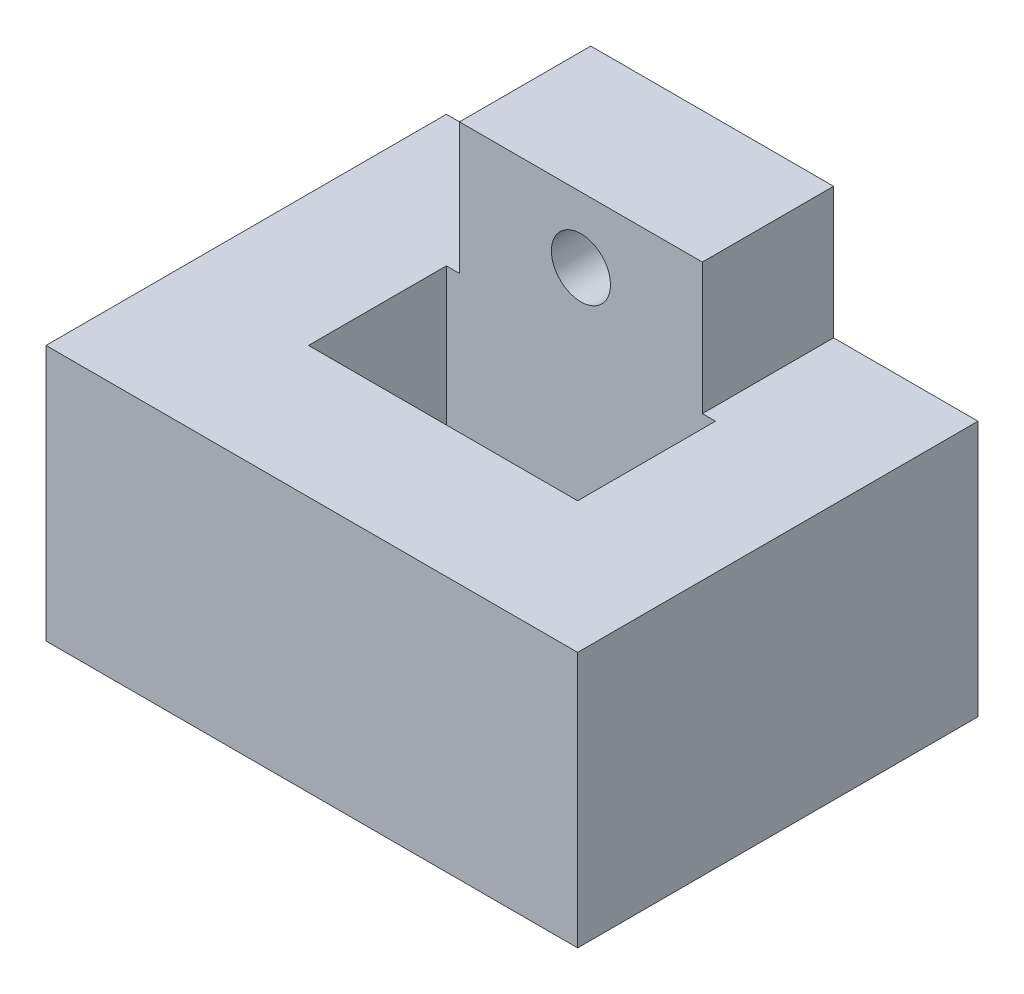
ISO-10303-21;
HEADER;
FILE_DESCRIPTION(('STEP AP214'),'2;1');
FILE_NAME('part.step','',(''),(''),'','','');
FILE_SCHEMA(('AUTOMOTIVE_DESIGN { 1 0 10303 214 1 1 1 1 }'));
ENDSEC;
DATA;
#1=APPLICATION_CONTEXT('core data for automotive mechanical design processes');
#2=APPLICATION_PROTOCOL_DEFINITION('international standard','automotive_design',2000,#1);
#3=PRODUCT_CONTEXT('',#1,'mechanical');
#4=PRODUCT('Part','Part','',(#3));
#5=PRODUCT_RELATED_PRODUCT_CATEGORY('part','',(#4));
#6=PRODUCT_DEFINITION_FORMATION('','',#4);
#7=PRODUCT_DEFINITION_CONTEXT('part definition',#1,'design');
#8=PRODUCT_DEFINITION('design','',#6,#7);
#9=PRODUCT_DEFINITION_SHAPE('','',#8);
#10=(LENGTH_UNIT() NAMED_UNIT(*) SI_UNIT(.MILLI.,.METRE.));
#11=(NAMED_UNIT(*) PLANE_ANGLE_UNIT() SI_UNIT($,.RADIAN.));
#12=(NAMED_UNIT(*) SI_UNIT($,.STERADIAN.) SOLID_ANGLE_UNIT());
#13=UNCERTAINTY_MEASURE_WITH_UNIT(LENGTH_MEASURE(1.E-05),#10,'distance_accuracy_value','');
#14=(GEOMETRIC_REPRESENTATION_CONTEXT(3) GLOBAL_UNCERTAINTY_ASSIGNED_CONTEXT((#13)) GLOBAL_UNIT_ASSIGNED_CONTEXT((#10,
#11,#12)) REPRESENTATION_CONTEXT('',''));
#15=CARTESIAN_POINT('',(0.,0.,0.));
#16=DIRECTION('',(0.,0.,1.));
#17=DIRECTION('',(1.,0.,0.));
#18=AXIS2_PLACEMENT_3D('',#15,#16,#17);
#19=CARTESIAN_POINT('',(0.,19.5,0.));
#20=DIRECTION('',(0.,1.,0.));
#21=DIRECTION('',(0.,0.,1.));
#22=AXIS2_PLACEMENT_3D('',#19,#20,#21);
#23=PLANE('',#22);
#24=DIRECTION('',(0.,0.,-1.));
#25=VECTOR('',#24,1.);
#26=CARTESIAN_POINT('',(9.25,19.5,15.7797408448131));
#27=LINE('',#26,#25);
#28=CARTESIAN_POINT('',(9.25,19.5,-5.25000000000003));
#29=VERTEX_POINT('',#28);
#30=CARTESIAN_POINT('',(9.25,19.5,-15.2500000000001));
#31=VERTEX_POINT('',#30);
#32=EDGE_CURVE('E140',#29,#31,#27,.T.);
#33=ORIENTED_EDGE('',*,*,#32,.F.);
#34=DIRECTION('',(-1.,0.,0.));
#35=VECTOR('',#34,1.);
#36=CARTESIAN_POINT('',(-10.25,19.5,-5.25000000000003));
#37=LINE('',#36,#35);
#38=CARTESIAN_POINT('',(10.25,19.5,-5.25000000000003));
#39=VERTEX_POINT('',#38);
#40=EDGE_CURVE('E137',#39,#29,#37,.T.);
#41=ORIENTED_EDGE('',*,*,#40,.F.);
#42=DIRECTION('',(0.,0.,-1.));
#43=VECTOR('',#42,1.);
#44=CARTESIAN_POINT('',(10.25,19.5,-5.25000000000003));
#45=LINE('',#44,#43);
#46=CARTESIAN_POINT('',(10.25,19.5,5.24999999999998));
#47=VERTEX_POINT('',#46);
#48=EDGE_CURVE('E273',#47,#39,#45,.T.);
#49=ORIENTED_EDGE('',*,*,#48,.F.);
#50=DIRECTION('',(1.,0.,0.));
#51=VECTOR('',#50,1.);
#52=CARTESIAN_POINT('',(-10.25,19.5,5.24999999999998));
#53=LINE('',#52,#51);
#54=CARTESIAN_POINT('',(-10.25,19.5,5.24999999999998));
#55=VERTEX_POINT('',#54);
#56=EDGE_CURVE('E284',#55,#47,#53,.T.);
#57=ORIENTED_EDGE('',*,*,#56,.F.);
#58=DIRECTION('',(0.,0.,1.));
#59=VECTOR('',#58,1.);
#60=CARTESIAN_POINT('',(-10.25,19.5,-5.25000000000003));
#61=LINE('',#60,#59);
#62=CARTESIAN_POINT('',(-10.25,19.5,-5.25000000000003));
#63=VERTEX_POINT('',#62);
#64=EDGE_CURVE('E277',#63,#55,#61,.T.);
#65=ORIENTED_EDGE('',*,*,#64,.F.);
#66=CARTESIAN_POINT('',(-9.25,19.5,-5.25000000000003));
#67=VERTEX_POINT('',#66);
#68=EDGE_CURVE('E269',#67,#63,#37,.T.);
#69=ORIENTED_EDGE('',*,*,#68,.F.);
#70=DIRECTION('',(0.,0.,-1.));
#71=VECTOR('',#70,1.);
#72=CARTESIAN_POINT('',(-9.25,19.5,15.7797408448131));
#73=LINE('',#72,#71);
#74=CARTESIAN_POINT('',(-9.25,19.5,-15.2500000000001));
#75=VERTEX_POINT('',#74);
#76=EDGE_CURVE('E141',#67,#75,#73,.T.);
#77=ORIENTED_EDGE('',*,*,#76,.T.);
#78=DIRECTION('',(-1.,0.,0.));
#79=VECTOR('',#78,1.);
#80=CARTESIAN_POINT('',(-20.25,19.5,-15.2500000000001));
#81=LINE('',#80,#79);
#82=CARTESIAN_POINT('',(-20.25,19.5,-15.2500000000001));
#83=VERTEX_POINT('',#82);
#84=EDGE_CURVE('E259',#75,#83,#81,.T.);
#85=ORIENTED_EDGE('',*,*,#84,.T.);
#86=DIRECTION('',(0.,0.,1.));
#87=VECTOR('',#86,1.);
#88=CARTESIAN_POINT('',(-20.25,19.5,-15.2500000000001));
#89=LINE('',#88,#87);
#90=CARTESIAN_POINT('',(-20.25,19.5,15.2499999999998));
#91=VERTEX_POINT('',#90);
#92=EDGE_CURVE('E258',#83,#91,#89,.T.);
#93=ORIENTED_EDGE('',*,*,#92,.T.);
#94=DIRECTION('',(1.,0.,0.));
#95=VECTOR('',#94,1.);
#96=CARTESIAN_POINT('',(-20.25,19.5,15.2499999999998));
#97=LINE('',#96,#95);
#98=CARTESIAN_POINT('',(20.25,19.5,15.2499999999998));
#99=VERTEX_POINT('',#98);
#100=EDGE_CURVE('E238',#91,#99,#97,.T.);
#101=ORIENTED_EDGE('',*,*,#100,.T.);
#102=DIRECTION('',(0.,0.,-1.));
#103=VECTOR('',#102,1.);
#104=CARTESIAN_POINT('',(20.25,19.5,-15.2500000000001));
#105=LINE('',#104,#103);
#106=CARTESIAN_POINT('',(20.25,19.5,-15.2500000000001));
#107=VERTEX_POINT('',#106);
#108=EDGE_CURVE('E231',#99,#107,#105,.T.);
#109=ORIENTED_EDGE('',*,*,#108,.T.);
#110=EDGE_CURVE('E255',#107,#31,#81,.T.);
#111=ORIENTED_EDGE('',*,*,#110,.T.);
#112=EDGE_LOOP('',(#33,#41,#49,#57,#65,#69,#77,#85,#93,#101,#109,#111));
#113=FACE_BOUND('',#112,.T.);
#114=ADVANCED_FACE('F37',(#113),#23,.T.);
#115=CARTESIAN_POINT('',(0.,0.,0.));
#116=DIRECTION('',(0.,1.,0.));
#117=DIRECTION('',(0.,0.,1.));
#118=AXIS2_PLACEMENT_3D('',#115,#116,#117);
#119=PLANE('',#118);
#120=DIRECTION('',(0.,0.,-1.));
#121=VECTOR('',#120,1.);
#122=CARTESIAN_POINT('',(20.25,0.,-15.2500000000001));
#123=LINE('',#122,#121);
#124=CARTESIAN_POINT('',(20.25,0.,15.2499999999998));
#125=VERTEX_POINT('',#124);
#126=CARTESIAN_POINT('',(20.25,0.,-15.2500000000001));
#127=VERTEX_POINT('',#126);
#128=EDGE_CURVE('E236',#125,#127,#123,.T.);
#129=ORIENTED_EDGE('',*,*,#128,.F.);
#130=DIRECTION('',(1.,0.,0.));
#131=VECTOR('',#130,1.);
#132=CARTESIAN_POINT('',(-20.25,0.,15.2499999999998));
#133=LINE('',#132,#131);
#134=CARTESIAN_POINT('',(-20.25,0.,15.2499999999998));
#135=VERTEX_POINT('',#134);
#136=EDGE_CURVE('E222',#135,#125,#133,.T.);
#137=ORIENTED_EDGE('',*,*,#136,.F.);
#138=DIRECTION('',(0.,0.,1.));
#139=VECTOR('',#138,1.);
#140=CARTESIAN_POINT('',(-20.25,0.,-15.2500000000001));
#141=LINE('',#140,#139);
#142=CARTESIAN_POINT('',(-20.25,0.,-15.2500000000001));
#143=VERTEX_POINT('',#142);
#144=EDGE_CURVE('E232',#143,#135,#141,.T.);
#145=ORIENTED_EDGE('',*,*,#144,.F.);
#146=DIRECTION('',(-1.,0.,0.));
#147=VECTOR('',#146,1.);
#148=CARTESIAN_POINT('',(-20.25,0.,-15.2500000000001));
#149=LINE('',#148,#147);
#150=EDGE_CURVE('E241',#127,#143,#149,.T.);
#151=ORIENTED_EDGE('',*,*,#150,.F.);
#152=EDGE_LOOP('',(#129,#137,#145,#151));
#153=FACE_BOUND('',#152,.T.);
#154=DIRECTION('',(0.,0.,-1.));
#155=VECTOR('',#154,1.);
#156=CARTESIAN_POINT('',(10.25,0.,-5.25000000000003));
#157=LINE('',#156,#155);
#158=CARTESIAN_POINT('',(10.25,0.,5.24999999999998));
#159=VERTEX_POINT('',#158);
#160=CARTESIAN_POINT('',(10.25,0.,-5.25000000000003));
#161=VERTEX_POINT('',#160);
#162=EDGE_CURVE('E292',#159,#161,#157,.T.);
#163=ORIENTED_EDGE('',*,*,#162,.T.);
#164=DIRECTION('',(-1.,0.,0.));
#165=VECTOR('',#164,1.);
#166=CARTESIAN_POINT('',(-10.25,0.,-5.25000000000003));
#167=LINE('',#166,#165);
#168=CARTESIAN_POINT('',(-10.25,0.,-5.25000000000003));
#169=VERTEX_POINT('',#168);
#170=EDGE_CURVE('E295',#161,#169,#167,.T.);
#171=ORIENTED_EDGE('',*,*,#170,.T.);
#172=DIRECTION('',(0.,0.,1.));
#173=VECTOR('',#172,1.);
#174=CARTESIAN_POINT('',(-10.25,0.,-5.25000000000003));
#175=LINE('',#174,#173);
#176=CARTESIAN_POINT('',(-10.25,0.,5.24999999999998));
#177=VERTEX_POINT('',#176);
#178=EDGE_CURVE('E280',#169,#177,#175,.T.);
#179=ORIENTED_EDGE('',*,*,#178,.T.);
#180=DIRECTION('',(1.,0.,0.));
#181=VECTOR('',#180,1.);
#182=CARTESIAN_POINT('',(-10.25,0.,5.24999999999998));
#183=LINE('',#182,#181);
#184=EDGE_CURVE('E299',#177,#159,#183,.T.);
#185=ORIENTED_EDGE('',*,*,#184,.T.);
#186=EDGE_LOOP('',(#163,#171,#179,#185));
#187=FACE_BOUND('',#186,.T.);
#188=ADVANCED_FACE('F198',(#153,#187),#119,.F.);
#189=CARTESIAN_POINT('',(20.25,19.5,-15.2500000000001));
#190=DIRECTION('',(-1.,0.,0.));
#191=DIRECTION('',(0.,0.,1.));
#192=AXIS2_PLACEMENT_3D('',#189,#190,#191);
#193=PLANE('',#192);
#194=ORIENTED_EDGE('',*,*,#128,.T.);
#195=DIRECTION('',(0.,-1.,0.));
#196=VECTOR('',#195,1.);
#197=CARTESIAN_POINT('',(20.25,19.5,-15.2500000000001));
#198=LINE('',#197,#196);
#199=EDGE_CURVE('E11',#107,#127,#198,.T.);
#200=ORIENTED_EDGE('',*,*,#199,.F.);
#201=ORIENTED_EDGE('',*,*,#108,.F.);
#202=DIRECTION('',(0.,-1.,0.));
#203=VECTOR('',#202,1.);
#204=CARTESIAN_POINT('',(20.25,19.5,15.2499999999998));
#205=LINE('',#204,#203);
#206=EDGE_CURVE('E225',#99,#125,#205,.T.);
#207=ORIENTED_EDGE('',*,*,#206,.T.);
#208=EDGE_LOOP('',(#194,#200,#201,#207));
#209=FACE_BOUND('',#208,.T.);
#210=ADVANCED_FACE('F39',(#209),#193,.F.);
#211=CARTESIAN_POINT('',(-20.25,19.5,-15.2500000000001));
#212=DIRECTION('',(0.,0.,1.));
#213=DIRECTION('',(1.,0.,0.));
#214=AXIS2_PLACEMENT_3D('',#211,#212,#213);
#215=PLANE('',#214);
#216=CARTESIAN_POINT('',(0.,4.5,-15.2500000000001));
#217=DIRECTION('',(0.,0.,1.));
#218=DIRECTION('',(1.,0.,0.));
#219=AXIS2_PLACEMENT_3D('',#216,#217,#218);
#220=CIRCLE('',#219,1.);
#221=CARTESIAN_POINT('',(1.,4.5,-15.2500000000001));
#222=VERTEX_POINT('',#221);
#223=EDGE_CURVE('E179',#222,#222,#220,.T.);
#224=ORIENTED_EDGE('',*,*,#223,.T.);
#225=EDGE_LOOP('',(#224));
#226=FACE_BOUND('',#225,.T.);
#227=ORIENTED_EDGE('',*,*,#150,.T.);
#228=DIRECTION('',(0.,-1.,0.));
#229=VECTOR('',#228,1.);
#230=CARTESIAN_POINT('',(-20.25,19.5,-15.2500000000001));
#231=LINE('',#230,#229);
#232=EDGE_CURVE('E46',#83,#143,#231,.T.);
#233=ORIENTED_EDGE('',*,*,#232,.F.);
#234=ORIENTED_EDGE('',*,*,#84,.F.);
#235=DIRECTION('',(0.,1.,0.));
#236=VECTOR('',#235,1.);
#237=CARTESIAN_POINT('',(-9.25,19.5,-15.2500000000001));
#238=LINE('',#237,#236);
#239=CARTESIAN_POINT('',(-9.25,29.5,-15.2500000000001));
#240=VERTEX_POINT('',#239);
#241=EDGE_CURVE('E54',#75,#240,#238,.T.);
#242=ORIENTED_EDGE('',*,*,#241,.T.);
#243=DIRECTION('',(1.,0.,0.));
#244=VECTOR('',#243,1.);
#245=CARTESIAN_POINT('',(-9.25,29.5,-15.2500000000001));
#246=LINE('',#245,#244);
#247=CARTESIAN_POINT('',(9.25,29.5,-15.2500000000001));
#248=VERTEX_POINT('',#247);
#249=EDGE_CURVE('E175',#240,#248,#246,.T.);
#250=ORIENTED_EDGE('',*,*,#249,.T.);
#251=DIRECTION('',(0.,-1.,0.));
#252=VECTOR('',#251,1.);
#253=CARTESIAN_POINT('',(9.25,19.5,-15.2500000000001));
#254=LINE('',#253,#252);
#255=EDGE_CURVE('E147',#248,#31,#254,.T.);
#256=ORIENTED_EDGE('',*,*,#255,.T.);
#257=ORIENTED_EDGE('',*,*,#110,.F.);
#258=ORIENTED_EDGE('',*,*,#199,.T.);
#259=EDGE_LOOP('',(#227,#233,#234,#242,#250,#256,#257,#258));
#260=FACE_BOUND('',#259,.T.);
#261=CARTESIAN_POINT('',(0.,24.5,-15.2500000000001));
#262=DIRECTION('',(0.,0.,-1.));
#263=DIRECTION('',(-1.,0.,0.));
#264=AXIS2_PLACEMENT_3D('',#261,#262,#263);
#265=CIRCLE('',#264,2.25);
#266=CARTESIAN_POINT('',(-2.25,24.5,-15.2500000000001));
#267=VERTEX_POINT('',#266);
#268=EDGE_CURVE('E151',#267,#267,#265,.T.);
#269=ORIENTED_EDGE('',*,*,#268,.F.);
#270=EDGE_LOOP('',(#269));
#271=FACE_BOUND('',#270,.T.);
#272=ADVANCED_FACE('F187',(#226,#260,#271),#215,.F.);
#273=CARTESIAN_POINT('',(-20.25,19.5,-15.2500000000001));
#274=DIRECTION('',(1.,0.,0.));
#275=DIRECTION('',(0.,0.,-1.));
#276=AXIS2_PLACEMENT_3D('',#273,#274,#275);
#277=PLANE('',#276);
#278=ORIENTED_EDGE('',*,*,#144,.T.);
#279=DIRECTION('',(0.,-1.,0.));
#280=VECTOR('',#279,1.);
#281=CARTESIAN_POINT('',(-20.25,19.5,15.2499999999998));
#282=LINE('',#281,#280);
#283=EDGE_CURVE('E228',#91,#135,#282,.T.);
#284=ORIENTED_EDGE('',*,*,#283,.F.);
#285=ORIENTED_EDGE('',*,*,#92,.F.);
#286=ORIENTED_EDGE('',*,*,#232,.T.);
#287=EDGE_LOOP('',(#278,#284,#285,#286));
#288=FACE_BOUND('',#287,.T.);
#289=ADVANCED_FACE('F189',(#288),#277,.F.);
#290=CARTESIAN_POINT('',(-20.25,19.5,15.2499999999998));
#291=DIRECTION('',(0.,0.,-1.));
#292=DIRECTION('',(-1.,0.,0.));
#293=AXIS2_PLACEMENT_3D('',#290,#291,#292);
#294=PLANE('',#293);
#295=ORIENTED_EDGE('',*,*,#136,.T.);
#296=ORIENTED_EDGE('',*,*,#206,.F.);
#297=ORIENTED_EDGE('',*,*,#100,.F.);
#298=ORIENTED_EDGE('',*,*,#283,.T.);
#299=EDGE_LOOP('',(#295,#296,#297,#298));
#300=FACE_BOUND('',#299,.T.);
#301=ADVANCED_FACE('F195',(#300),#294,.F.);
#302=CARTESIAN_POINT('',(10.25,19.5,-5.25000000000003));
#303=DIRECTION('',(-1.,0.,0.));
#304=DIRECTION('',(0.,0.,1.));
#305=AXIS2_PLACEMENT_3D('',#302,#303,#304);
#306=PLANE('',#305);
#307=ORIENTED_EDGE('',*,*,#162,.F.);
#308=DIRECTION('',(0.,-1.,0.));
#309=VECTOR('',#308,1.);
#310=CARTESIAN_POINT('',(10.25,19.5,5.24999999999998));
#311=LINE('',#310,#309);
#312=EDGE_CURVE('E286',#47,#159,#311,.T.);
#313=ORIENTED_EDGE('',*,*,#312,.F.);
#314=ORIENTED_EDGE('',*,*,#48,.T.);
#315=DIRECTION('',(0.,-1.,0.));
#316=VECTOR('',#315,1.);
#317=CARTESIAN_POINT('',(10.25,19.5,-5.25000000000003));
#318=LINE('',#317,#316);
#319=EDGE_CURVE('E242',#39,#161,#318,.T.);
#320=ORIENTED_EDGE('',*,*,#319,.T.);
#321=EDGE_LOOP('',(#307,#313,#314,#320));
#322=FACE_BOUND('',#321,.T.);
#323=ADVANCED_FACE('F210',(#322),#306,.T.);
#324=CARTESIAN_POINT('',(-10.25,19.5,-5.25000000000003));
#325=DIRECTION('',(0.,0.,1.));
#326=DIRECTION('',(1.,0.,0.));
#327=AXIS2_PLACEMENT_3D('',#324,#325,#326);
#328=PLANE('',#327);
#329=ORIENTED_EDGE('',*,*,#170,.F.);
#330=ORIENTED_EDGE('',*,*,#319,.F.);
#331=ORIENTED_EDGE('',*,*,#40,.T.);
#332=DIRECTION('',(0.,-1.,0.));
#333=VECTOR('',#332,1.);
#334=CARTESIAN_POINT('',(9.25,19.5,-5.25000000000003));
#335=LINE('',#334,#333);
#336=CARTESIAN_POINT('',(9.25,29.5,-5.25000000000003));
#337=VERTEX_POINT('',#336);
#338=EDGE_CURVE('E128',#337,#29,#335,.T.);
#339=ORIENTED_EDGE('',*,*,#338,.F.);
#340=DIRECTION('',(1.,0.,0.));
#341=VECTOR('',#340,1.);
#342=CARTESIAN_POINT('',(-9.25,29.5,-5.25000000000003));
#343=LINE('',#342,#341);
#344=CARTESIAN_POINT('',(-9.25,29.5,-5.25000000000003));
#345=VERTEX_POINT('',#344);
#346=EDGE_CURVE('E133',#345,#337,#343,.T.);
#347=ORIENTED_EDGE('',*,*,#346,.F.);
#348=DIRECTION('',(0.,1.,0.));
#349=VECTOR('',#348,1.);
#350=CARTESIAN_POINT('',(-9.25,19.5,-5.25000000000003));
#351=LINE('',#350,#349);
#352=EDGE_CURVE('E170',#67,#345,#351,.T.);
#353=ORIENTED_EDGE('',*,*,#352,.F.);
#354=ORIENTED_EDGE('',*,*,#68,.T.);
#355=DIRECTION('',(0.,-1.,0.));
#356=VECTOR('',#355,1.);
#357=CARTESIAN_POINT('',(-10.25,19.5,-5.25000000000003));
#358=LINE('',#357,#356);
#359=EDGE_CURVE('E246',#63,#169,#358,.T.);
#360=ORIENTED_EDGE('',*,*,#359,.T.);
#361=EDGE_LOOP('',(#329,#330,#331,#339,#347,#353,#354,#360));
#362=FACE_BOUND('',#361,.T.);
#363=CARTESIAN_POINT('',(0.,24.5,-5.25000000000003));
#364=DIRECTION('',(0.,0.,1.));
#365=DIRECTION('',(1.,0.,0.));
#366=AXIS2_PLACEMENT_3D('',#363,#364,#365);
#367=CIRCLE('',#366,2.25);
#368=CARTESIAN_POINT('',(2.25,24.5,-5.25000000000003));
#369=VERTEX_POINT('',#368);
#370=EDGE_CURVE('E160',#369,#369,#367,.F.);
#371=ORIENTED_EDGE('',*,*,#370,.T.);
#372=EDGE_LOOP('',(#371));
#373=FACE_BOUND('',#372,.T.);
#374=ADVANCED_FACE('F130',(#362,#373),#328,.T.);
#375=CARTESIAN_POINT('',(-10.25,19.5,-5.25000000000003));
#376=DIRECTION('',(1.,0.,0.));
#377=DIRECTION('',(0.,0.,-1.));
#378=AXIS2_PLACEMENT_3D('',#375,#376,#377);
#379=PLANE('',#378);
#380=ORIENTED_EDGE('',*,*,#178,.F.);
#381=ORIENTED_EDGE('',*,*,#359,.F.);
#382=ORIENTED_EDGE('',*,*,#64,.T.);
#383=DIRECTION('',(0.,-1.,0.));
#384=VECTOR('',#383,1.);
#385=CARTESIAN_POINT('',(-10.25,19.5,5.24999999999998));
#386=LINE('',#385,#384);
#387=EDGE_CURVE('E62',#55,#177,#386,.T.);
#388=ORIENTED_EDGE('',*,*,#387,.T.);
#389=EDGE_LOOP('',(#380,#381,#382,#388));
#390=FACE_BOUND('',#389,.T.);
#391=ADVANCED_FACE('F276',(#390),#379,.T.);
#392=CARTESIAN_POINT('',(-10.25,19.5,5.24999999999998));
#393=DIRECTION('',(0.,0.,-1.));
#394=DIRECTION('',(-1.,0.,0.));
#395=AXIS2_PLACEMENT_3D('',#392,#393,#394);
#396=PLANE('',#395);
#397=ORIENTED_EDGE('',*,*,#184,.F.);
#398=ORIENTED_EDGE('',*,*,#387,.F.);
#399=ORIENTED_EDGE('',*,*,#56,.T.);
#400=ORIENTED_EDGE('',*,*,#312,.T.);
#401=EDGE_LOOP('',(#397,#398,#399,#400));
#402=FACE_BOUND('',#401,.T.);
#403=ADVANCED_FACE('F304',(#402),#396,.T.);
#404=CARTESIAN_POINT('',(0.,4.5,-18.2500000000001));
#405=DIRECTION('',(0.,0.,1.));
#406=DIRECTION('',(1.,0.,0.));
#407=AXIS2_PLACEMENT_3D('',#404,#405,#406);
#408=CYLINDRICAL_SURFACE('',#407,1.);
#409=CARTESIAN_POINT('',(0.,4.5,-18.2500000000001));
#410=DIRECTION('',(0.,0.,1.));
#411=DIRECTION('',(1.,0.,0.));
#412=AXIS2_PLACEMENT_3D('',#409,#410,#411);
#413=CIRCLE('',#412,1.);
#414=CARTESIAN_POINT('',(1.,4.5,-18.2500000000001));
#415=VERTEX_POINT('',#414);
#416=EDGE_CURVE('E296',#415,#415,#413,.T.);
#417=ORIENTED_EDGE('',*,*,#416,.T.);
#418=EDGE_LOOP('',(#417));
#419=FACE_BOUND('',#418,.T.);
#420=ORIENTED_EDGE('',*,*,#223,.F.);
#421=EDGE_LOOP('',(#420));
#422=FACE_BOUND('',#421,.T.);
#423=ADVANCED_FACE('F312',(#419,#422),#408,.T.);
#424=CARTESIAN_POINT('',(0.,4.5,-18.2500000000001));
#425=DIRECTION('',(0.,0.,1.));
#426=DIRECTION('',(1.,0.,0.));
#427=AXIS2_PLACEMENT_3D('',#424,#425,#426);
#428=PLANE('',#427);
#429=ORIENTED_EDGE('',*,*,#416,.F.);
#430=EDGE_LOOP('',(#429));
#431=FACE_BOUND('',#430,.T.);
#432=ADVANCED_FACE('F315',(#431),#428,.F.);
#433=CARTESIAN_POINT('',(-9.25,19.5,15.7797408448131));
#434=DIRECTION('',(-1.,0.,0.));
#435=DIRECTION('',(0.,0.,1.));
#436=AXIS2_PLACEMENT_3D('',#433,#434,#435);
#437=PLANE('',#436);
#438=ORIENTED_EDGE('',*,*,#76,.F.);
#439=ORIENTED_EDGE('',*,*,#352,.T.);
#440=DIRECTION('',(0.,0.,-1.));
#441=VECTOR('',#440,1.);
#442=CARTESIAN_POINT('',(-9.25,29.5,15.7797408448131));
#443=LINE('',#442,#441);
#444=EDGE_CURVE('E155',#345,#240,#443,.T.);
#445=ORIENTED_EDGE('',*,*,#444,.T.);
#446=ORIENTED_EDGE('',*,*,#241,.F.);
#447=EDGE_LOOP('',(#438,#439,#445,#446));
#448=FACE_BOUND('',#447,.T.);
#449=ADVANCED_FACE('F270',(#448),#437,.T.);
#450=CARTESIAN_POINT('',(9.25,19.5,15.7797408448131));
#451=DIRECTION('',(1.,0.,0.));
#452=DIRECTION('',(0.,0.,-1.));
#453=AXIS2_PLACEMENT_3D('',#450,#451,#452);
#454=PLANE('',#453);
#455=DIRECTION('',(0.,0.,-1.));
#456=VECTOR('',#455,1.);
#457=CARTESIAN_POINT('',(9.25,29.5,15.7797408448131));
#458=LINE('',#457,#456);
#459=EDGE_CURVE('E144',#337,#248,#458,.T.);
#460=ORIENTED_EDGE('',*,*,#459,.F.);
#461=ORIENTED_EDGE('',*,*,#338,.T.);
#462=ORIENTED_EDGE('',*,*,#32,.T.);
#463=ORIENTED_EDGE('',*,*,#255,.F.);
#464=EDGE_LOOP('',(#460,#461,#462,#463));
#465=FACE_BOUND('',#464,.T.);
#466=ADVANCED_FACE('F145',(#465),#454,.T.);
#467=CARTESIAN_POINT('',(-9.25,29.5,15.7797408448131));
#468=DIRECTION('',(0.,1.,0.));
#469=DIRECTION('',(0.,0.,1.));
#470=AXIS2_PLACEMENT_3D('',#467,#468,#469);
#471=PLANE('',#470);
#472=ORIENTED_EDGE('',*,*,#444,.F.);
#473=ORIENTED_EDGE('',*,*,#346,.T.);
#474=ORIENTED_EDGE('',*,*,#459,.T.);
#475=ORIENTED_EDGE('',*,*,#249,.F.);
#476=EDGE_LOOP('',(#472,#473,#474,#475));
#477=FACE_BOUND('',#476,.T.);
#478=ADVANCED_FACE('F154',(#477),#471,.T.);
#479=CARTESIAN_POINT('',(0.,24.5,15.7797408448131));
#480=DIRECTION('',(0.,0.,-1.));
#481=DIRECTION('',(-1.,0.,0.));
#482=AXIS2_PLACEMENT_3D('',#479,#480,#481);
#483=CYLINDRICAL_SURFACE('',#482,2.25);
#484=ORIENTED_EDGE('',*,*,#268,.T.);
#485=EDGE_LOOP('',(#484));
#486=FACE_BOUND('',#485,.T.);
#487=ORIENTED_EDGE('',*,*,#370,.F.);
#488=EDGE_LOOP('',(#487));
#489=FACE_BOUND('',#488,.T.);
#490=ADVANCED_FACE('F184',(#486,#489),#483,.F.);
#491=CLOSED_SHELL('',(#114,#188,#210,#272,#289,#301,#323,#374,#391,#403,#423,#432,#449,#466,
#478,#490));
#492=MANIFOLD_SOLID_BREP('B2',#491);
#493=ADVANCED_BREP_SHAPE_REPRESENTATION('',(#18,#492),#14);
#494=SHAPE_DEFINITION_REPRESENTATION(#9,#493);
ENDSEC;
END-ISO-10303-21;
